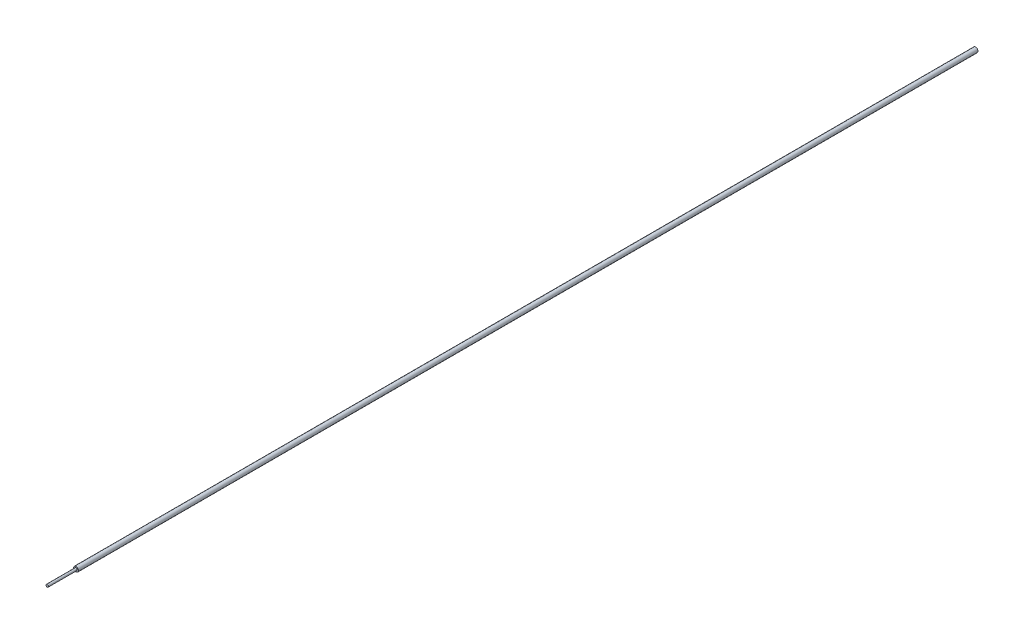
ISO-10303-21;
HEADER;
FILE_DESCRIPTION(('STEP AP214'),'2;1');
FILE_NAME('part.step','',(''),(''),'','','');
FILE_SCHEMA(('AUTOMOTIVE_DESIGN { 1 0 10303 214 1 1 1 1 }'));
ENDSEC;
DATA;
#1=APPLICATION_CONTEXT('core data for automotive mechanical design processes');
#2=APPLICATION_PROTOCOL_DEFINITION('international standard','automotive_design',2000,#1);
#3=PRODUCT_CONTEXT('',#1,'mechanical');
#4=PRODUCT('Part','Part','',(#3));
#5=PRODUCT_RELATED_PRODUCT_CATEGORY('part','',(#4));
#6=PRODUCT_DEFINITION_FORMATION('','',#4);
#7=PRODUCT_DEFINITION_CONTEXT('part definition',#1,'design');
#8=PRODUCT_DEFINITION('design','',#6,#7);
#9=PRODUCT_DEFINITION_SHAPE('','',#8);
#10=(LENGTH_UNIT() NAMED_UNIT(*) SI_UNIT(.MILLI.,.METRE.));
#11=(NAMED_UNIT(*) PLANE_ANGLE_UNIT() SI_UNIT($,.RADIAN.));
#12=(NAMED_UNIT(*) SI_UNIT($,.STERADIAN.) SOLID_ANGLE_UNIT());
#13=UNCERTAINTY_MEASURE_WITH_UNIT(LENGTH_MEASURE(1.E-05),#10,'distance_accuracy_value','');
#14=(GEOMETRIC_REPRESENTATION_CONTEXT(3) GLOBAL_UNCERTAINTY_ASSIGNED_CONTEXT((#13)) GLOBAL_UNIT_ASSIGNED_CONTEXT((#10,
#11,#12)) REPRESENTATION_CONTEXT('',''));
#15=CARTESIAN_POINT('',(0.,0.,0.));
#16=DIRECTION('',(0.,0.,1.));
#17=DIRECTION('',(1.,0.,0.));
#18=AXIS2_PLACEMENT_3D('',#15,#16,#17);
#19=CARTESIAN_POINT('',(0.,0.,0.));
#20=DIRECTION('',(0.,0.,-1.));
#21=DIRECTION('',(-1.,0.,0.));
#22=AXIS2_PLACEMENT_3D('',#19,#20,#21);
#23=PLANE('',#22);
#24=CARTESIAN_POINT('',(0.,0.,0.));
#25=DIRECTION('',(0.,0.,-1.));
#26=DIRECTION('',(-1.,0.,0.));
#27=AXIS2_PLACEMENT_3D('',#24,#25,#26);
#28=CIRCLE('',#27,0.5);
#29=CARTESIAN_POINT('',(-0.5,0.,0.));
#30=VERTEX_POINT('',#29);
#31=EDGE_CURVE('E10',#30,#30,#28,.T.);
#32=ORIENTED_EDGE('',*,*,#31,.F.);
#33=EDGE_LOOP('',(#32));
#34=FACE_BOUND('',#33,.T.);
#35=ADVANCED_FACE('F32',(#34),#23,.F.);
#36=CARTESIAN_POINT('',(0.,0.,0.));
#37=DIRECTION('',(0.,0.,-1.));
#38=DIRECTION('',(-1.,0.,0.));
#39=AXIS2_PLACEMENT_3D('',#36,#37,#38);
#40=CYLINDRICAL_SURFACE('',#39,0.5);
#41=CARTESIAN_POINT('',(0.,0.,-12.));
#42=DIRECTION('',(0.,0.,-1.));
#43=DIRECTION('',(-1.,0.,0.));
#44=AXIS2_PLACEMENT_3D('',#41,#42,#43);
#45=CIRCLE('',#44,0.5);
#46=CARTESIAN_POINT('',(-0.5,0.,-12.));
#47=VERTEX_POINT('',#46);
#48=EDGE_CURVE('E38',#47,#47,#45,.T.);
#49=ORIENTED_EDGE('',*,*,#48,.F.);
#50=EDGE_LOOP('',(#49));
#51=FACE_BOUND('',#50,.T.);
#52=ORIENTED_EDGE('',*,*,#31,.T.);
#53=EDGE_LOOP('',(#52));
#54=FACE_BOUND('',#53,.T.);
#55=ADVANCED_FACE('F62',(#51,#54),#40,.T.);
#56=CARTESIAN_POINT('',(0.5,0.,-12.));
#57=DIRECTION('',(0.,0.,-1.));
#58=DIRECTION('',(-1.,0.,0.));
#59=AXIS2_PLACEMENT_3D('',#56,#57,#58);
#60=PLANE('',#59);
#61=CARTESIAN_POINT('',(0.,0.,-12.));
#62=DIRECTION('',(0.,0.,-1.));
#63=DIRECTION('',(-1.,0.,0.));
#64=AXIS2_PLACEMENT_3D('',#61,#62,#63);
#65=CIRCLE('',#64,0.999999999999999);
#66=CARTESIAN_POINT('',(-0.999999999999999,0.,-12.));
#67=VERTEX_POINT('',#66);
#68=EDGE_CURVE('E42',#67,#67,#65,.T.);
#69=ORIENTED_EDGE('',*,*,#68,.F.);
#70=EDGE_LOOP('',(#69));
#71=FACE_BOUND('',#70,.T.);
#72=ORIENTED_EDGE('',*,*,#48,.T.);
#73=EDGE_LOOP('',(#72));
#74=FACE_BOUND('',#73,.T.);
#75=ADVANCED_FACE('F57',(#71,#74),#60,.F.);
#76=CARTESIAN_POINT('',(0.,0.,0.));
#77=DIRECTION('',(0.,0.,-1.));
#78=DIRECTION('',(-1.,0.,0.));
#79=AXIS2_PLACEMENT_3D('',#76,#77,#78);
#80=CYLINDRICAL_SURFACE('',#79,0.999999999999999);
#81=CARTESIAN_POINT('',(0.,0.,-387.));
#82=DIRECTION('',(0.,0.,-1.));
#83=DIRECTION('',(-1.,0.,0.));
#84=AXIS2_PLACEMENT_3D('',#81,#82,#83);
#85=CIRCLE('',#84,0.999999999999998);
#86=CARTESIAN_POINT('',(-0.999999999999998,0.,-387.));
#87=VERTEX_POINT('',#86);
#88=EDGE_CURVE('E46',#87,#87,#85,.T.);
#89=ORIENTED_EDGE('',*,*,#88,.F.);
#90=EDGE_LOOP('',(#89));
#91=FACE_BOUND('',#90,.T.);
#92=ORIENTED_EDGE('',*,*,#68,.T.);
#93=EDGE_LOOP('',(#92));
#94=FACE_BOUND('',#93,.T.);
#95=ADVANCED_FACE('F54',(#91,#94),#80,.T.);
#96=CARTESIAN_POINT('',(0.,0.,-387.));
#97=DIRECTION('',(0.,0.,1.));
#98=DIRECTION('',(1.,0.,0.));
#99=AXIS2_PLACEMENT_3D('',#96,#97,#98);
#100=PLANE('',#99);
#101=ORIENTED_EDGE('',*,*,#88,.T.);
#102=EDGE_LOOP('',(#101));
#103=FACE_BOUND('',#102,.T.);
#104=ADVANCED_FACE('F52',(#103),#100,.F.);
#105=CLOSED_SHELL('',(#35,#55,#75,#95,#104));
#106=MANIFOLD_SOLID_BREP('B2',#105);
#107=ADVANCED_BREP_SHAPE_REPRESENTATION('',(#18,#106),#14);
#108=SHAPE_DEFINITION_REPRESENTATION(#9,#107);
ENDSEC;
END-ISO-10303-21;
